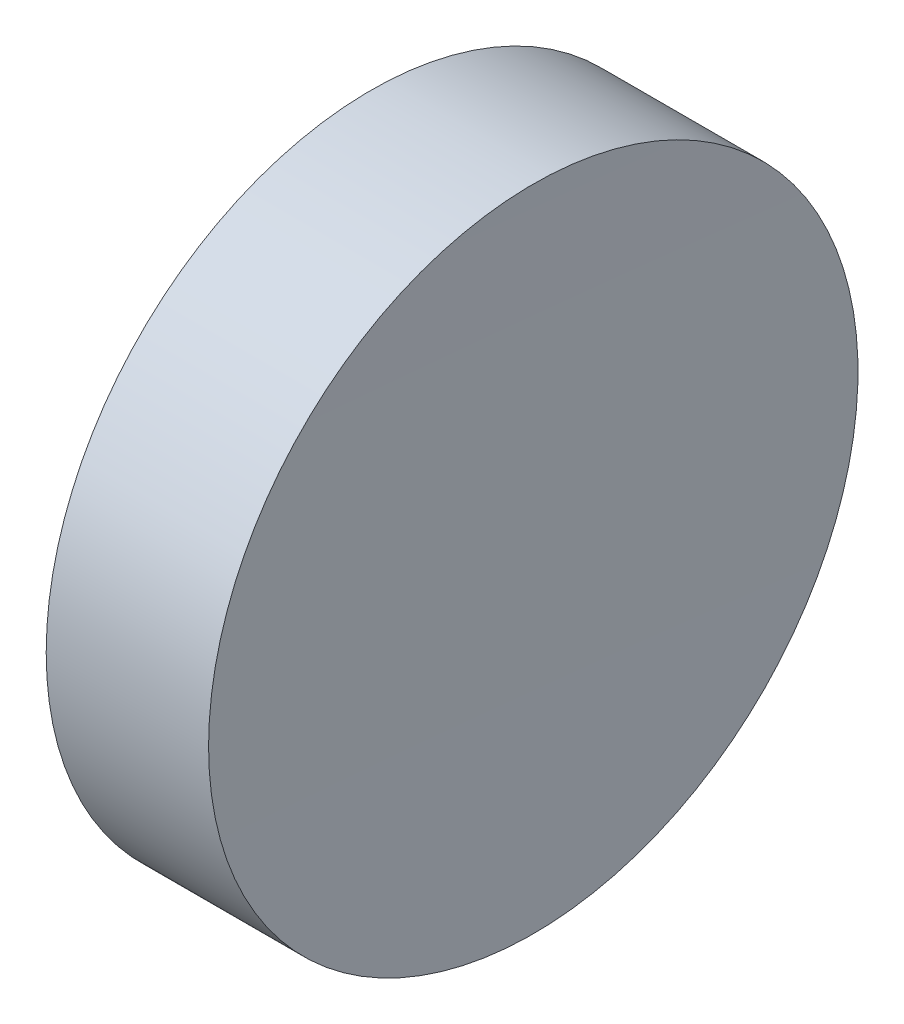
ISO-10303-21;
HEADER;
FILE_DESCRIPTION(('STEP AP214'),'2;1');
FILE_NAME('part.step','',(''),(''),'','','');
FILE_SCHEMA(('AUTOMOTIVE_DESIGN { 1 0 10303 214 1 1 1 1 }'));
ENDSEC;
DATA;
#1=APPLICATION_CONTEXT('core data for automotive mechanical design processes');
#2=APPLICATION_PROTOCOL_DEFINITION('international standard','automotive_design',2000,#1);
#3=PRODUCT_CONTEXT('',#1,'mechanical');
#4=PRODUCT('Part','Part','',(#3));
#5=PRODUCT_RELATED_PRODUCT_CATEGORY('part','',(#4));
#6=PRODUCT_DEFINITION_FORMATION('','',#4);
#7=PRODUCT_DEFINITION_CONTEXT('part definition',#1,'design');
#8=PRODUCT_DEFINITION('design','',#6,#7);
#9=PRODUCT_DEFINITION_SHAPE('','',#8);
#10=(LENGTH_UNIT() NAMED_UNIT(*) SI_UNIT(.MILLI.,.METRE.));
#11=(NAMED_UNIT(*) PLANE_ANGLE_UNIT() SI_UNIT($,.RADIAN.));
#12=(NAMED_UNIT(*) SI_UNIT($,.STERADIAN.) SOLID_ANGLE_UNIT());
#13=UNCERTAINTY_MEASURE_WITH_UNIT(LENGTH_MEASURE(1.E-05),#10,'distance_accuracy_value','');
#14=(GEOMETRIC_REPRESENTATION_CONTEXT(3) GLOBAL_UNCERTAINTY_ASSIGNED_CONTEXT((#13)) GLOBAL_UNIT_ASSIGNED_CONTEXT((#10,
#11,#12)) REPRESENTATION_CONTEXT('',''));
#15=CARTESIAN_POINT('',(0.,0.,0.));
#16=DIRECTION('',(0.,0.,1.));
#17=DIRECTION('',(1.,0.,0.));
#18=AXIS2_PLACEMENT_3D('',#15,#16,#17);
#19=CARTESIAN_POINT('',(0.,0.,0.));
#20=DIRECTION('',(1.,0.,0.));
#21=DIRECTION('',(0.,0.,-1.));
#22=AXIS2_PLACEMENT_3D('',#19,#20,#21);
#23=PLANE('',#22);
#24=CARTESIAN_POINT('',(0.,0.,0.));
#25=DIRECTION('',(-1.,0.,0.));
#26=DIRECTION('',(0.,0.,1.));
#27=AXIS2_PLACEMENT_3D('',#24,#25,#26);
#28=CIRCLE('',#27,12.7);
#29=CARTESIAN_POINT('',(0.,0.,12.7));
#30=VERTEX_POINT('',#29);
#31=EDGE_CURVE('E39',#30,#30,#28,.T.);
#32=ORIENTED_EDGE('',*,*,#31,.T.);
#33=EDGE_LOOP('',(#32));
#34=FACE_BOUND('',#33,.T.);
#35=ADVANCED_FACE('F33',(#34),#23,.F.);
#36=CARTESIAN_POINT('',(1006.27,0.,0.));
#37=DIRECTION('',(-1.,0.,0.));
#38=DIRECTION('',(0.,0.,1.));
#39=AXIS2_PLACEMENT_3D('',#36,#37,#38);
#40=SPHERICAL_SURFACE('',#39,1000.);
#41=CARTESIAN_POINT('',(6.35064825207032,0.,0.));
#42=DIRECTION('',(-1.,0.,0.));
#43=DIRECTION('',(0.,0.,1.));
#44=AXIS2_PLACEMENT_3D('',#41,#42,#43);
#45=CIRCLE('',#44,12.7000000000006);
#46=CARTESIAN_POINT('',(6.35064825207032,0.,12.7000000000006));
#47=VERTEX_POINT('',#46);
#48=EDGE_CURVE('E10',#47,#47,#45,.T.);
#49=ORIENTED_EDGE('',*,*,#48,.F.);
#50=EDGE_LOOP('',(#49));
#51=FACE_BOUND('',#50,.T.);
#52=ADVANCED_FACE('F48',(#51),#40,.F.);
#53=CARTESIAN_POINT('',(0.,0.,0.));
#54=DIRECTION('',(-1.,0.,0.));
#55=DIRECTION('',(0.,0.,1.));
#56=AXIS2_PLACEMENT_3D('',#53,#54,#55);
#57=CYLINDRICAL_SURFACE('',#56,12.7000000000003);
#58=ORIENTED_EDGE('',*,*,#31,.F.);
#59=EDGE_LOOP('',(#58));
#60=FACE_BOUND('',#59,.T.);
#61=ORIENTED_EDGE('',*,*,#48,.T.);
#62=EDGE_LOOP('',(#61));
#63=FACE_BOUND('',#62,.T.);
#64=ADVANCED_FACE('F46',(#60,#63),#57,.T.);
#65=CLOSED_SHELL('',(#35,#52,#64));
#66=MANIFOLD_SOLID_BREP('B2',#65);
#67=ADVANCED_BREP_SHAPE_REPRESENTATION('',(#18,#66),#14);
#68=SHAPE_DEFINITION_REPRESENTATION(#9,#67);
ENDSEC;
END-ISO-10303-21;
